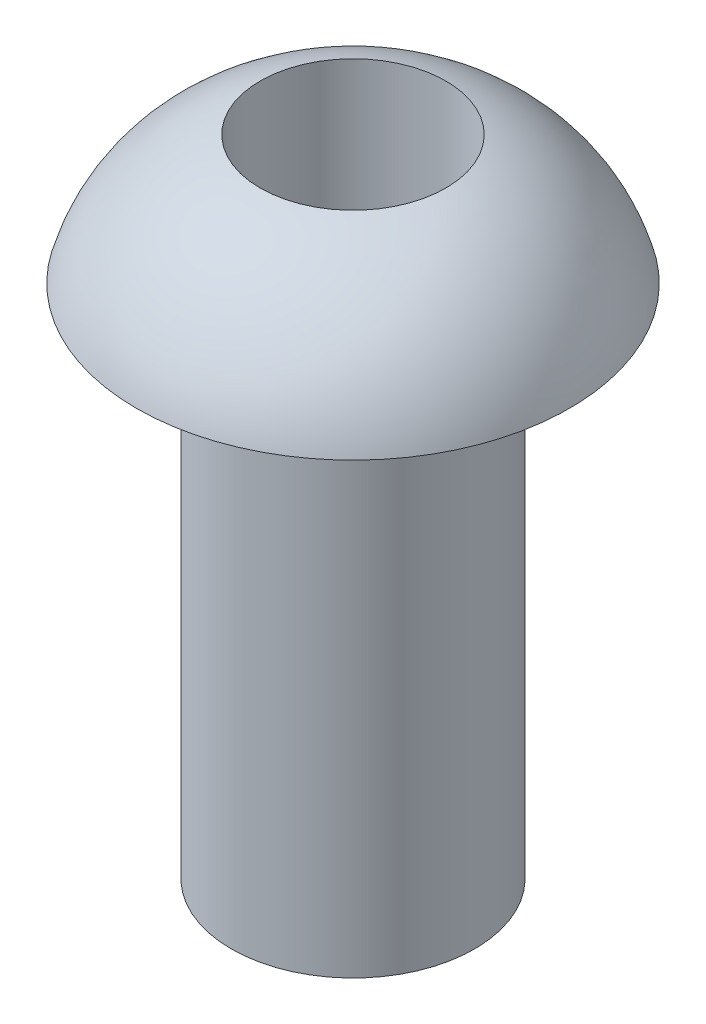
ISO-10303-21;
HEADER;
FILE_DESCRIPTION(('STEP AP214'),'2;1');
FILE_NAME('part.step','',(''),(''),'','','');
FILE_SCHEMA(('AUTOMOTIVE_DESIGN { 1 0 10303 214 1 1 1 1 }'));
ENDSEC;
DATA;
#1=APPLICATION_CONTEXT('core data for automotive mechanical design processes');
#2=APPLICATION_PROTOCOL_DEFINITION('international standard','automotive_design',2000,#1);
#3=PRODUCT_CONTEXT('',#1,'mechanical');
#4=PRODUCT('Part','Part','',(#3));
#5=PRODUCT_RELATED_PRODUCT_CATEGORY('part','',(#4));
#6=PRODUCT_DEFINITION_FORMATION('','',#4);
#7=PRODUCT_DEFINITION_CONTEXT('part definition',#1,'design');
#8=PRODUCT_DEFINITION('design','',#6,#7);
#9=PRODUCT_DEFINITION_SHAPE('','',#8);
#10=(LENGTH_UNIT() NAMED_UNIT(*) SI_UNIT(.MILLI.,.METRE.));
#11=(NAMED_UNIT(*) PLANE_ANGLE_UNIT() SI_UNIT($,.RADIAN.));
#12=(NAMED_UNIT(*) SI_UNIT($,.STERADIAN.) SOLID_ANGLE_UNIT());
#13=UNCERTAINTY_MEASURE_WITH_UNIT(LENGTH_MEASURE(1.E-05),#10,'distance_accuracy_value','');
#14=(GEOMETRIC_REPRESENTATION_CONTEXT(3) GLOBAL_UNCERTAINTY_ASSIGNED_CONTEXT((#13)) GLOBAL_UNIT_ASSIGNED_CONTEXT((#10,
#11,#12)) REPRESENTATION_CONTEXT('',''));
#15=CARTESIAN_POINT('',(0.,0.,0.));
#16=DIRECTION('',(0.,0.,1.));
#17=DIRECTION('',(1.,0.,0.));
#18=AXIS2_PLACEMENT_3D('',#15,#16,#17);
#19=CARTESIAN_POINT('',(0.,0.,0.));
#20=DIRECTION('',(0.,1.,0.));
#21=DIRECTION('',(0.,0.,0.999999999999998));
#22=AXIS2_PLACEMENT_3D('',#19,#20,#21);
#23=PLANE('',#22);
#24=CARTESIAN_POINT('',(0.,0.,0.));
#25=DIRECTION('',(0.,1.,0.));
#26=DIRECTION('',(0.,0.,0.999999999999998));
#27=AXIS2_PLACEMENT_3D('',#24,#25,#26);
#28=CIRCLE('',#27,0.7493);
#29=CARTESIAN_POINT('',(0.,0.,0.749299999999999));
#30=VERTEX_POINT('',#29);
#31=EDGE_CURVE('E38',#30,#30,#28,.T.);
#32=ORIENTED_EDGE('',*,*,#31,.F.);
#33=EDGE_LOOP('',(#32));
#34=FACE_BOUND('',#33,.T.);
#35=CARTESIAN_POINT('',(0.,0.,0.));
#36=DIRECTION('',(0.,1.,0.));
#37=DIRECTION('',(0.,0.,0.999999999999998));
#38=AXIS2_PLACEMENT_3D('',#35,#36,#37);
#39=CIRCLE('',#38,0.5715);
#40=CARTESIAN_POINT('',(0.,0.,0.571499999999999));
#41=VERTEX_POINT('',#40);
#42=EDGE_CURVE('E45',#41,#41,#39,.T.);
#43=ORIENTED_EDGE('',*,*,#42,.T.);
#44=EDGE_LOOP('',(#43));
#45=FACE_BOUND('',#44,.T.);
#46=ADVANCED_FACE('F34',(#34,#45),#23,.F.);
#47=CARTESIAN_POINT('',(0.,3.17500000000001,0.));
#48=DIRECTION('',(0.,-1.,0.));
#49=DIRECTION('',(0.,0.,-0.999999999999998));
#50=AXIS2_PLACEMENT_3D('',#47,#48,#49);
#51=CYLINDRICAL_SURFACE('',#50,0.7493);
#52=CARTESIAN_POINT('',(0.,3.17500000000001,0.));
#53=DIRECTION('',(0.,1.,0.));
#54=DIRECTION('',(0.,0.,0.999999999999998));
#55=AXIS2_PLACEMENT_3D('',#52,#53,#54);
#56=CIRCLE('',#55,0.7493);
#57=CARTESIAN_POINT('',(0.,3.17500000000001,0.749299999999973));
#58=VERTEX_POINT('',#57);
#59=EDGE_CURVE('E10',#58,#58,#56,.T.);
#60=ORIENTED_EDGE('',*,*,#59,.F.);
#61=EDGE_LOOP('',(#60));
#62=FACE_BOUND('',#61,.T.);
#63=ORIENTED_EDGE('',*,*,#31,.T.);
#64=EDGE_LOOP('',(#63));
#65=FACE_BOUND('',#64,.T.);
#66=ADVANCED_FACE('F36',(#62,#65),#51,.T.);
#67=CARTESIAN_POINT('',(0.,3.17500000000001,0.));
#68=DIRECTION('',(0.,-1.,0.));
#69=DIRECTION('',(0.,0.,-0.999999999999998));
#70=AXIS2_PLACEMENT_3D('',#67,#68,#69);
#71=CYLINDRICAL_SURFACE('',#70,0.5715);
#72=ORIENTED_EDGE('',*,*,#42,.F.);
#73=EDGE_LOOP('',(#72));
#74=FACE_BOUND('',#73,.T.);
#75=CARTESIAN_POINT('',(0.,3.96875000000002,0.));
#76=DIRECTION('',(0.,1.,0.));
#77=DIRECTION('',(0.,0.,0.999999999999998));
#78=AXIS2_PLACEMENT_3D('',#75,#76,#77);
#79=CIRCLE('',#78,0.5715);
#80=CARTESIAN_POINT('',(0.,3.96875000000002,0.571500000000014));
#81=VERTEX_POINT('',#80);
#82=EDGE_CURVE('E49',#81,#81,#79,.T.);
#83=ORIENTED_EDGE('',*,*,#82,.T.);
#84=EDGE_LOOP('',(#83));
#85=FACE_BOUND('',#84,.T.);
#86=ADVANCED_FACE('F60',(#74,#85),#71,.F.);
#87=CARTESIAN_POINT('',(0.,3.17500000000001,0.));
#88=DIRECTION('',(0.,1.,0.));
#89=DIRECTION('',(0.,0.,0.999999999999998));
#90=AXIS2_PLACEMENT_3D('',#87,#88,#89);
#91=PLANE('',#90);
#92=CARTESIAN_POINT('',(0.,3.17500000000001,0.));
#93=DIRECTION('',(0.,1.,0.));
#94=DIRECTION('',(0.,0.,0.999999999999998));
#95=AXIS2_PLACEMENT_3D('',#92,#93,#94);
#96=CIRCLE('',#95,1.3335);
#97=CARTESIAN_POINT('',(0.,3.17500000000001,1.33349999999997));
#98=VERTEX_POINT('',#97);
#99=EDGE_CURVE('E52',#98,#98,#96,.T.);
#100=ORIENTED_EDGE('',*,*,#99,.F.);
#101=EDGE_LOOP('',(#100));
#102=FACE_BOUND('',#101,.T.);
#103=ORIENTED_EDGE('',*,*,#59,.T.);
#104=EDGE_LOOP('',(#103));
#105=FACE_BOUND('',#104,.T.);
#106=ADVANCED_FACE('F58',(#102,#105),#91,.F.);
#107=CARTESIAN_POINT('',(0.,2.88056942393426,0.));
#108=DIRECTION('',(0.,1.,0.));
#109=DIRECTION('',(0.,0.,0.999999999999998));
#110=AXIS2_PLACEMENT_3D('',#107,#108,#109);
#111=DEGENERATE_TOROIDAL_SURFACE('',#110,0.232390024931514,1.1397949558222,.T.);
#112=ORIENTED_EDGE('',*,*,#82,.F.);
#113=EDGE_LOOP('',(#112));
#114=FACE_BOUND('',#113,.T.);
#115=ORIENTED_EDGE('',*,*,#99,.T.);
#116=EDGE_LOOP('',(#115));
#117=FACE_BOUND('',#116,.T.);
#118=ADVANCED_FACE('F56',(#114,#117),#111,.T.);
#119=CLOSED_SHELL('',(#46,#66,#86,#106,#118));
#120=MANIFOLD_SOLID_BREP('B2',#119);
#121=ADVANCED_BREP_SHAPE_REPRESENTATION('',(#18,#120),#14);
#122=SHAPE_DEFINITION_REPRESENTATION(#9,#121);
ENDSEC;
END-ISO-10303-21;
